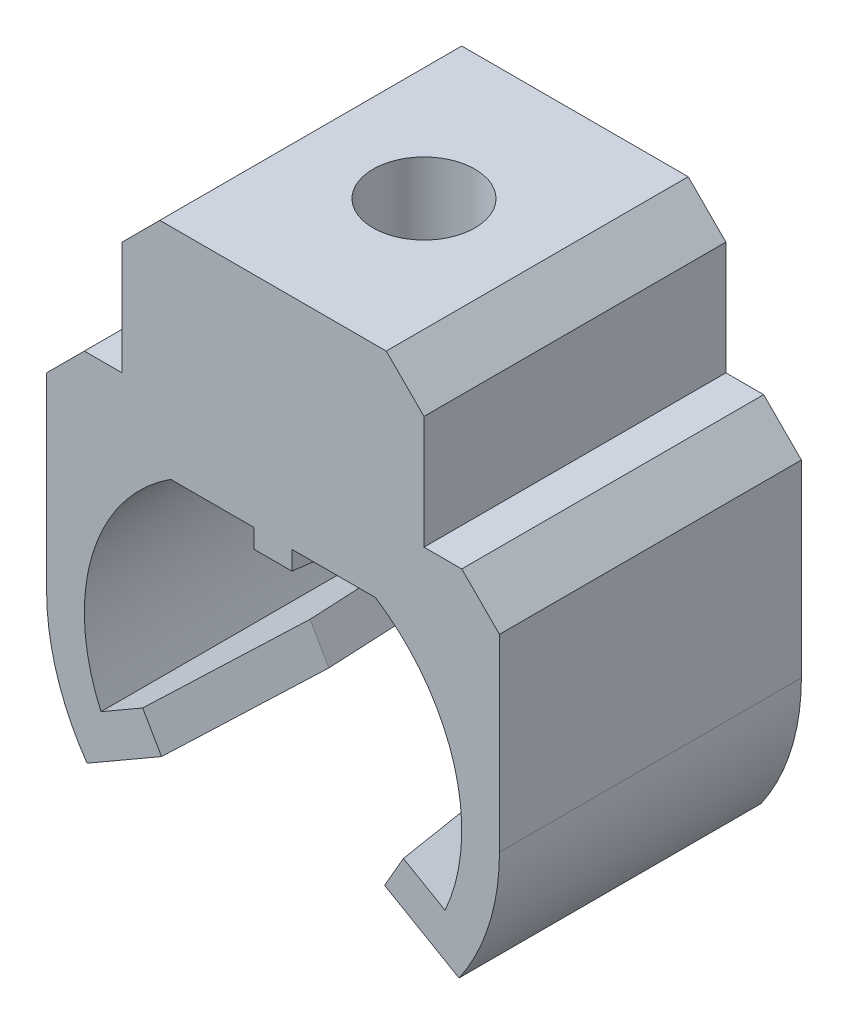
ISO-10303-21;
HEADER;
FILE_DESCRIPTION(('STEP AP214'),'2;1');
FILE_NAME('part.step','',(''),(''),'','','');
FILE_SCHEMA(('AUTOMOTIVE_DESIGN { 1 0 10303 214 1 1 1 1 }'));
ENDSEC;
DATA;
#1=APPLICATION_CONTEXT('core data for automotive mechanical design processes');
#2=APPLICATION_PROTOCOL_DEFINITION('international standard','automotive_design',2000,#1);
#3=PRODUCT_CONTEXT('',#1,'mechanical');
#4=PRODUCT('Part','Part','',(#3));
#5=PRODUCT_RELATED_PRODUCT_CATEGORY('part','',(#4));
#6=PRODUCT_DEFINITION_FORMATION('','',#4);
#7=PRODUCT_DEFINITION_CONTEXT('part definition',#1,'design');
#8=PRODUCT_DEFINITION('design','',#6,#7);
#9=PRODUCT_DEFINITION_SHAPE('','',#8);
#10=(LENGTH_UNIT() NAMED_UNIT(*) SI_UNIT(.MILLI.,.METRE.));
#11=(NAMED_UNIT(*) PLANE_ANGLE_UNIT() SI_UNIT($,.RADIAN.));
#12=(NAMED_UNIT(*) SI_UNIT($,.STERADIAN.) SOLID_ANGLE_UNIT());
#13=UNCERTAINTY_MEASURE_WITH_UNIT(LENGTH_MEASURE(1.E-05),#10,'distance_accuracy_value','');
#14=(GEOMETRIC_REPRESENTATION_CONTEXT(3) GLOBAL_UNCERTAINTY_ASSIGNED_CONTEXT((#13)) GLOBAL_UNIT_ASSIGNED_CONTEXT((#10,
#11,#12)) REPRESENTATION_CONTEXT('',''));
#15=CARTESIAN_POINT('',(0.,0.,0.));
#16=DIRECTION('',(0.,0.,1.));
#17=DIRECTION('',(1.,0.,0.));
#18=AXIS2_PLACEMENT_3D('',#15,#16,#17);
#19=CARTESIAN_POINT('',(0.,0.,8.));
#20=DIRECTION('',(0.,0.,-1.));
#21=DIRECTION('',(-1.,0.,0.));
#22=AXIS2_PLACEMENT_3D('',#19,#20,#21);
#23=CYLINDRICAL_SURFACE('',#22,5.);
#24=CARTESIAN_POINT('',(0.,0.,0.));
#25=DIRECTION('',(0.,0.,-1.));
#26=DIRECTION('',(1.,0.,0.));
#27=AXIS2_PLACEMENT_3D('',#24,#25,#26);
#28=CIRCLE('',#27,5.);
#29=CARTESIAN_POINT('',(2.71293199325011,4.2,0.));
#30=VERTEX_POINT('',#29);
#31=CARTESIAN_POINT('',(4.55842198490352,-2.05445589087434,0.));
#32=VERTEX_POINT('',#31);
#33=EDGE_CURVE('E253',#30,#32,#28,.T.);
#34=ORIENTED_EDGE('',*,*,#33,.T.);
#35=DIRECTION('',(0.,0.,-1.));
#36=VECTOR('',#35,1.);
#37=CARTESIAN_POINT('',(4.55842198490352,-2.05445589087434,8.));
#38=LINE('',#37,#36);
#39=CARTESIAN_POINT('',(4.55842198490352,-2.05445589087434,8.));
#40=VERTEX_POINT('',#39);
#41=EDGE_CURVE('E233',#40,#32,#38,.T.);
#42=ORIENTED_EDGE('',*,*,#41,.F.);
#43=CARTESIAN_POINT('',(0.,0.,8.));
#44=DIRECTION('',(0.,0.,-1.));
#45=DIRECTION('',(1.,0.,0.));
#46=AXIS2_PLACEMENT_3D('',#43,#44,#45);
#47=CIRCLE('',#46,5.);
#48=CARTESIAN_POINT('',(2.71293199325011,4.2,8.));
#49=VERTEX_POINT('',#48);
#50=EDGE_CURVE('E240',#49,#40,#47,.T.);
#51=ORIENTED_EDGE('',*,*,#50,.F.);
#52=DIRECTION('',(0.,0.,-1.));
#53=VECTOR('',#52,1.);
#54=CARTESIAN_POINT('',(2.71293199325011,4.2,8.));
#55=LINE('',#54,#53);
#56=EDGE_CURVE('E365',#49,#30,#55,.T.);
#57=ORIENTED_EDGE('',*,*,#56,.T.);
#58=EDGE_LOOP('',(#34,#42,#51,#57));
#59=FACE_BOUND('',#58,.T.);
#60=ADVANCED_FACE('F35',(#59),#23,.F.);
#61=CARTESIAN_POINT('',(3.0212812921102,-1.16698729810779,8.));
#62=DIRECTION('',(-0.500000000000001,-0.866025403784438,0.));
#63=DIRECTION('',(0.866025403784438,-0.500000000000001,0.));
#64=AXIS2_PLACEMENT_3D('',#61,#62,#63);
#65=PLANE('',#64);
#66=DIRECTION('',(-0.866025403784438,0.500000000000001,0.));
#67=VECTOR('',#66,1.);
#68=CARTESIAN_POINT('',(3.0212812921102,-1.16698729810779,0.));
#69=LINE('',#68,#67);
#70=CARTESIAN_POINT('',(3.45429399400242,-1.41698729810779,0.));
#71=VERTEX_POINT('',#70);
#72=EDGE_CURVE('E372',#32,#71,#69,.T.);
#73=ORIENTED_EDGE('',*,*,#72,.T.);
#74=DIRECTION('',(0.107417231105915,-0.0620173672946044,-0.992277876713668));
#75=VECTOR('',#74,1.);
#76=CARTESIAN_POINT('',(3.0212812921102,-1.16698729810779,4.));
#77=LINE('',#76,#75);
#78=CARTESIAN_POINT('',(3.0212812921102,-1.16698729810779,3.99999999999988));
#79=VERTEX_POINT('',#78);
#80=EDGE_CURVE('E305',#71,#79,#77,.F.);
#81=ORIENTED_EDGE('',*,*,#80,.T.);
#82=DIRECTION('',(0.107417231105912,-0.0620173672946027,0.992277876713668));
#83=VECTOR('',#82,1.);
#84=CARTESIAN_POINT('',(3.45429399400242,-1.41698729810779,8.));
#85=LINE('',#84,#83);
#86=CARTESIAN_POINT('',(3.45429399400242,-1.41698729810779,8.));
#87=VERTEX_POINT('',#86);
#88=EDGE_CURVE('E236',#79,#87,#85,.T.);
#89=ORIENTED_EDGE('',*,*,#88,.T.);
#90=DIRECTION('',(-0.866025403784438,0.500000000000001,0.));
#91=VECTOR('',#90,1.);
#92=CARTESIAN_POINT('',(3.0212812921102,-1.16698729810779,8.));
#93=LINE('',#92,#91);
#94=EDGE_CURVE('E228',#40,#87,#93,.T.);
#95=ORIENTED_EDGE('',*,*,#94,.F.);
#96=ORIENTED_EDGE('',*,*,#41,.T.);
#97=EDGE_LOOP('',(#73,#81,#89,#95,#96));
#98=FACE_BOUND('',#97,.T.);
#99=ADVANCED_FACE('F231',(#98),#65,.F.);
#100=CARTESIAN_POINT('',(2.5212812921102,-2.03301270189222,8.));
#101=DIRECTION('',(0.499999999999998,0.86602540378444,0.));
#102=DIRECTION('',(-0.86602540378444,0.499999999999998,0.));
#103=AXIS2_PLACEMENT_3D('',#100,#101,#102);
#104=PLANE('',#103);
#105=DIRECTION('',(-0.107417231105912,0.0620173672946023,-0.992277876713668));
#106=VECTOR('',#105,1.);
#107=CARTESIAN_POINT('',(2.95429399400242,-2.28301270189222,8.));
#108=LINE('',#107,#106);
#109=CARTESIAN_POINT('',(2.95429399400242,-2.28301270189222,8.));
#110=VERTEX_POINT('',#109);
#111=CARTESIAN_POINT('',(2.5212812921102,-2.03301270189222,3.99999999999988));
#112=VERTEX_POINT('',#111);
#113=EDGE_CURVE('E297',#110,#112,#108,.T.);
#114=ORIENTED_EDGE('',*,*,#113,.T.);
#115=DIRECTION('',(-0.107417231105915,0.062017367294604,0.992277876713668));
#116=VECTOR('',#115,1.);
#117=CARTESIAN_POINT('',(2.5212812921102,-2.03301270189222,4.));
#118=LINE('',#117,#116);
#119=CARTESIAN_POINT('',(2.95429399400242,-2.28301270189222,0.));
#120=VERTEX_POINT('',#119);
#121=EDGE_CURVE('E299',#112,#120,#118,.F.);
#122=ORIENTED_EDGE('',*,*,#121,.T.);
#123=DIRECTION('',(0.86602540378444,-0.499999999999998,0.));
#124=VECTOR('',#123,1.);
#125=CARTESIAN_POINT('',(2.5212812921102,-2.03301270189222,0.));
#126=LINE('',#125,#124);
#127=CARTESIAN_POINT('',(4.928078794302,-3.42257788766757,0.));
#128=VERTEX_POINT('',#127);
#129=EDGE_CURVE('E375',#120,#128,#126,.T.);
#130=ORIENTED_EDGE('',*,*,#129,.T.);
#131=DIRECTION('',(0.,0.,-1.));
#132=VECTOR('',#131,1.);
#133=CARTESIAN_POINT('',(4.928078794302,-3.42257788766757,8.));
#134=LINE('',#133,#132);
#135=CARTESIAN_POINT('',(4.928078794302,-3.42257788766757,8.));
#136=VERTEX_POINT('',#135);
#137=EDGE_CURVE('E255',#136,#128,#134,.T.);
#138=ORIENTED_EDGE('',*,*,#137,.F.);
#139=DIRECTION('',(0.86602540378444,-0.499999999999998,0.));
#140=VECTOR('',#139,1.);
#141=CARTESIAN_POINT('',(2.5212812921102,-2.03301270189222,8.));
#142=LINE('',#141,#140);
#143=EDGE_CURVE('E239',#110,#136,#142,.T.);
#144=ORIENTED_EDGE('',*,*,#143,.F.);
#145=EDGE_LOOP('',(#114,#122,#130,#138,#144));
#146=FACE_BOUND('',#145,.T.);
#147=ADVANCED_FACE('F560',(#146),#104,.F.);
#148=CARTESIAN_POINT('',(0.,0.,8.));
#149=DIRECTION('',(0.,0.,-1.));
#150=DIRECTION('',(-1.,0.,0.));
#151=AXIS2_PLACEMENT_3D('',#148,#149,#150);
#152=CYLINDRICAL_SURFACE('',#151,6.);
#153=CARTESIAN_POINT('',(0.,0.,0.));
#154=DIRECTION('',(0.,0.,1.));
#155=DIRECTION('',(1.,0.,0.));
#156=AXIS2_PLACEMENT_3D('',#153,#154,#155);
#157=CIRCLE('',#156,6.);
#158=CARTESIAN_POINT('',(6.,0.,0.));
#159=VERTEX_POINT('',#158);
#160=EDGE_CURVE('E377',#128,#159,#157,.T.);
#161=ORIENTED_EDGE('',*,*,#160,.T.);
#162=DIRECTION('',(0.,0.,-1.));
#163=VECTOR('',#162,1.);
#164=CARTESIAN_POINT('',(6.,0.,8.));
#165=LINE('',#164,#163);
#166=CARTESIAN_POINT('',(6.,0.,8.));
#167=VERTEX_POINT('',#166);
#168=EDGE_CURVE('E261',#167,#159,#165,.T.);
#169=ORIENTED_EDGE('',*,*,#168,.F.);
#170=CARTESIAN_POINT('',(0.,0.,8.));
#171=DIRECTION('',(0.,0.,1.));
#172=DIRECTION('',(1.,0.,0.));
#173=AXIS2_PLACEMENT_3D('',#170,#171,#172);
#174=CIRCLE('',#173,6.);
#175=EDGE_CURVE('E460',#136,#167,#174,.T.);
#176=ORIENTED_EDGE('',*,*,#175,.F.);
#177=ORIENTED_EDGE('',*,*,#137,.T.);
#178=EDGE_LOOP('',(#161,#169,#176,#177));
#179=FACE_BOUND('',#178,.T.);
#180=ADVANCED_FACE('F688',(#179),#152,.T.);
#181=CARTESIAN_POINT('',(6.,0.,8.));
#182=DIRECTION('',(-1.,0.,0.));
#183=DIRECTION('',(0.,0.,1.));
#184=AXIS2_PLACEMENT_3D('',#181,#182,#183);
#185=PLANE('',#184);
#186=DIRECTION('',(0.,1.,0.));
#187=VECTOR('',#186,1.);
#188=CARTESIAN_POINT('',(6.,0.,0.));
#189=LINE('',#188,#187);
#190=CARTESIAN_POINT('',(6.,5.00000000000001,0.));
#191=VERTEX_POINT('',#190);
#192=EDGE_CURVE('E379',#159,#191,#189,.T.);
#193=ORIENTED_EDGE('',*,*,#192,.T.);
#194=DIRECTION('',(0.,0.,1.));
#195=VECTOR('',#194,1.);
#196=CARTESIAN_POINT('',(6.,5.00000000000001,8.));
#197=LINE('',#196,#195);
#198=CARTESIAN_POINT('',(6.,5.00000000000001,8.));
#199=VERTEX_POINT('',#198);
#200=EDGE_CURVE('E290',#191,#199,#197,.T.);
#201=ORIENTED_EDGE('',*,*,#200,.T.);
#202=DIRECTION('',(0.,1.,0.));
#203=VECTOR('',#202,1.);
#204=CARTESIAN_POINT('',(6.,0.,8.));
#205=LINE('',#204,#203);
#206=EDGE_CURVE('E438',#167,#199,#205,.T.);
#207=ORIENTED_EDGE('',*,*,#206,.F.);
#208=ORIENTED_EDGE('',*,*,#168,.T.);
#209=EDGE_LOOP('',(#193,#201,#207,#208));
#210=FACE_BOUND('',#209,.T.);
#211=ADVANCED_FACE('F435',(#210),#185,.F.);
#212=CARTESIAN_POINT('',(4.,6.00000000000001,8.));
#213=DIRECTION('',(0.,-1.,0.));
#214=DIRECTION('',(1.,0.,0.));
#215=AXIS2_PLACEMENT_3D('',#212,#213,#214);
#216=PLANE('',#215);
#217=DIRECTION('',(-1.,0.,0.));
#218=VECTOR('',#217,1.);
#219=CARTESIAN_POINT('',(4.,6.00000000000001,8.));
#220=LINE('',#219,#218);
#221=CARTESIAN_POINT('',(5.,6.00000000000001,8.));
#222=VERTEX_POINT('',#221);
#223=CARTESIAN_POINT('',(4.,6.00000000000001,8.));
#224=VERTEX_POINT('',#223);
#225=EDGE_CURVE('E453',#222,#224,#220,.T.);
#226=ORIENTED_EDGE('',*,*,#225,.F.);
#227=DIRECTION('',(0.,0.,-1.));
#228=VECTOR('',#227,1.);
#229=CARTESIAN_POINT('',(5.,6.00000000000001,8.));
#230=LINE('',#229,#228);
#231=CARTESIAN_POINT('',(5.,6.00000000000001,0.));
#232=VERTEX_POINT('',#231);
#233=EDGE_CURVE('E287',#222,#232,#230,.T.);
#234=ORIENTED_EDGE('',*,*,#233,.T.);
#235=DIRECTION('',(-1.,0.,0.));
#236=VECTOR('',#235,1.);
#237=CARTESIAN_POINT('',(4.,6.00000000000001,0.));
#238=LINE('',#237,#236);
#239=CARTESIAN_POINT('',(4.,6.00000000000001,0.));
#240=VERTEX_POINT('',#239);
#241=EDGE_CURVE('E382',#232,#240,#238,.T.);
#242=ORIENTED_EDGE('',*,*,#241,.T.);
#243=DIRECTION('',(0.,0.,-1.));
#244=VECTOR('',#243,1.);
#245=CARTESIAN_POINT('',(4.,6.00000000000001,8.));
#246=LINE('',#245,#244);
#247=EDGE_CURVE('E428',#224,#240,#246,.T.);
#248=ORIENTED_EDGE('',*,*,#247,.F.);
#249=EDGE_LOOP('',(#226,#234,#242,#248));
#250=FACE_BOUND('',#249,.T.);
#251=ADVANCED_FACE('F451',(#250),#216,.F.);
#252=CARTESIAN_POINT('',(4.,9.99999999999999,8.));
#253=DIRECTION('',(-1.,0.,0.));
#254=DIRECTION('',(0.,-1.,0.));
#255=AXIS2_PLACEMENT_3D('',#252,#253,#254);
#256=PLANE('',#255);
#257=DIRECTION('',(0.,1.,0.));
#258=VECTOR('',#257,1.);
#259=CARTESIAN_POINT('',(4.,9.99999999999999,0.));
#260=LINE('',#259,#258);
#261=CARTESIAN_POINT('',(4.,8.99999999999998,0.));
#262=VERTEX_POINT('',#261);
#263=EDGE_CURVE('E384',#240,#262,#260,.T.);
#264=ORIENTED_EDGE('',*,*,#263,.T.);
#265=DIRECTION('',(0.,0.,1.));
#266=VECTOR('',#265,1.);
#267=CARTESIAN_POINT('',(4.,8.99999999999998,8.));
#268=LINE('',#267,#266);
#269=CARTESIAN_POINT('',(4.,8.99999999999999,8.));
#270=VERTEX_POINT('',#269);
#271=EDGE_CURVE('E285',#262,#270,#268,.T.);
#272=ORIENTED_EDGE('',*,*,#271,.T.);
#273=DIRECTION('',(0.,1.,0.));
#274=VECTOR('',#273,1.);
#275=CARTESIAN_POINT('',(4.,9.99999999999999,8.));
#276=LINE('',#275,#274);
#277=EDGE_CURVE('E456',#224,#270,#276,.T.);
#278=ORIENTED_EDGE('',*,*,#277,.F.);
#279=ORIENTED_EDGE('',*,*,#247,.T.);
#280=EDGE_LOOP('',(#264,#272,#278,#279));
#281=FACE_BOUND('',#280,.T.);
#282=ADVANCED_FACE('F545',(#281),#256,.F.);
#283=CARTESIAN_POINT('',(-4.,9.99999999999999,8.));
#284=DIRECTION('',(0.,-1.,0.));
#285=DIRECTION('',(0.,0.,-1.));
#286=AXIS2_PLACEMENT_3D('',#283,#284,#285);
#287=PLANE('',#286);
#288=CARTESIAN_POINT('',(0.,9.99999999999999,4.));
#289=DIRECTION('',(0.,1.,0.));
#290=DIRECTION('',(0.,0.,1.));
#291=AXIS2_PLACEMENT_3D('',#288,#289,#290);
#292=CIRCLE('',#291,1.35);
#293=CARTESIAN_POINT('',(0.,9.99999999999999,5.35));
#294=VERTEX_POINT('',#293);
#295=EDGE_CURVE('E335',#294,#294,#292,.T.);
#296=ORIENTED_EDGE('',*,*,#295,.F.);
#297=EDGE_LOOP('',(#296));
#298=FACE_BOUND('',#297,.T.);
#299=DIRECTION('',(-1.,0.,0.));
#300=VECTOR('',#299,1.);
#301=CARTESIAN_POINT('',(-4.,9.99999999999999,0.));
#302=LINE('',#301,#300);
#303=CARTESIAN_POINT('',(2.99999999999999,9.99999999999999,0.));
#304=VERTEX_POINT('',#303);
#305=CARTESIAN_POINT('',(-3.,9.99999999999999,0.));
#306=VERTEX_POINT('',#305);
#307=EDGE_CURVE('E387',#304,#306,#302,.T.);
#308=ORIENTED_EDGE('',*,*,#307,.T.);
#309=DIRECTION('',(0.,0.,1.));
#310=VECTOR('',#309,1.);
#311=CARTESIAN_POINT('',(-3.,9.99999999999999,8.));
#312=LINE('',#311,#310);
#313=CARTESIAN_POINT('',(-3.,9.99999999999999,8.));
#314=VERTEX_POINT('',#313);
#315=EDGE_CURVE('E275',#306,#314,#312,.T.);
#316=ORIENTED_EDGE('',*,*,#315,.T.);
#317=DIRECTION('',(-1.,0.,0.));
#318=VECTOR('',#317,1.);
#319=CARTESIAN_POINT('',(-4.,9.99999999999999,8.));
#320=LINE('',#319,#318);
#321=CARTESIAN_POINT('',(2.99999999999999,9.99999999999999,8.));
#322=VERTEX_POINT('',#321);
#323=EDGE_CURVE('E458',#322,#314,#320,.T.);
#324=ORIENTED_EDGE('',*,*,#323,.F.);
#325=DIRECTION('',(0.,0.,-1.));
#326=VECTOR('',#325,1.);
#327=CARTESIAN_POINT('',(2.99999999999999,9.99999999999999,8.));
#328=LINE('',#327,#326);
#329=EDGE_CURVE('E272',#322,#304,#328,.T.);
#330=ORIENTED_EDGE('',*,*,#329,.T.);
#331=EDGE_LOOP('',(#308,#316,#324,#330));
#332=FACE_BOUND('',#331,.T.);
#333=ADVANCED_FACE('F535',(#298,#332),#287,.F.);
#334=CARTESIAN_POINT('',(-4.,5.99999999999999,8.));
#335=DIRECTION('',(1.,0.,0.));
#336=DIRECTION('',(0.,1.,0.));
#337=AXIS2_PLACEMENT_3D('',#334,#335,#336);
#338=PLANE('',#337);
#339=DIRECTION('',(0.,-1.,0.));
#340=VECTOR('',#339,1.);
#341=CARTESIAN_POINT('',(-4.,5.99999999999999,8.));
#342=LINE('',#341,#340);
#343=CARTESIAN_POINT('',(-4.,8.99999999999999,8.));
#344=VERTEX_POINT('',#343);
#345=CARTESIAN_POINT('',(-4.,5.99999999999999,8.));
#346=VERTEX_POINT('',#345);
#347=EDGE_CURVE('E466',#344,#346,#342,.T.);
#348=ORIENTED_EDGE('',*,*,#347,.F.);
#349=DIRECTION('',(0.,0.,-1.));
#350=VECTOR('',#349,1.);
#351=CARTESIAN_POINT('',(-4.,8.99999999999999,8.));
#352=LINE('',#351,#350);
#353=CARTESIAN_POINT('',(-4.,8.99999999999999,0.));
#354=VERTEX_POINT('',#353);
#355=EDGE_CURVE('E254',#344,#354,#352,.T.);
#356=ORIENTED_EDGE('',*,*,#355,.T.);
#357=DIRECTION('',(0.,-1.,0.));
#358=VECTOR('',#357,1.);
#359=CARTESIAN_POINT('',(-4.,5.99999999999999,0.));
#360=LINE('',#359,#358);
#361=CARTESIAN_POINT('',(-4.,5.99999999999999,0.));
#362=VERTEX_POINT('',#361);
#363=EDGE_CURVE('E390',#354,#362,#360,.T.);
#364=ORIENTED_EDGE('',*,*,#363,.T.);
#365=DIRECTION('',(0.,0.,-1.));
#366=VECTOR('',#365,1.);
#367=CARTESIAN_POINT('',(-4.,5.99999999999999,8.));
#368=LINE('',#367,#366);
#369=EDGE_CURVE('E425',#346,#362,#368,.T.);
#370=ORIENTED_EDGE('',*,*,#369,.F.);
#371=EDGE_LOOP('',(#348,#356,#364,#370));
#372=FACE_BOUND('',#371,.T.);
#373=ADVANCED_FACE('F529',(#372),#338,.F.);
#374=CARTESIAN_POINT('',(-6.,5.99999999999999,8.));
#375=DIRECTION('',(0.,-1.,0.));
#376=DIRECTION('',(1.,0.,0.));
#377=AXIS2_PLACEMENT_3D('',#374,#375,#376);
#378=PLANE('',#377);
#379=DIRECTION('',(-1.,0.,0.));
#380=VECTOR('',#379,1.);
#381=CARTESIAN_POINT('',(-6.,5.99999999999999,0.));
#382=LINE('',#381,#380);
#383=CARTESIAN_POINT('',(-5.,5.99999999999999,0.));
#384=VERTEX_POINT('',#383);
#385=EDGE_CURVE('E392',#362,#384,#382,.T.);
#386=ORIENTED_EDGE('',*,*,#385,.T.);
#387=DIRECTION('',(0.,0.,1.));
#388=VECTOR('',#387,1.);
#389=CARTESIAN_POINT('',(-5.,5.99999999999999,8.));
#390=LINE('',#389,#388);
#391=CARTESIAN_POINT('',(-5.,5.99999999999999,8.));
#392=VERTEX_POINT('',#391);
#393=EDGE_CURVE('E295',#384,#392,#390,.T.);
#394=ORIENTED_EDGE('',*,*,#393,.T.);
#395=DIRECTION('',(-1.,0.,0.));
#396=VECTOR('',#395,1.);
#397=CARTESIAN_POINT('',(-6.,5.99999999999999,8.));
#398=LINE('',#397,#396);
#399=EDGE_CURVE('E468',#346,#392,#398,.T.);
#400=ORIENTED_EDGE('',*,*,#399,.F.);
#401=ORIENTED_EDGE('',*,*,#369,.T.);
#402=EDGE_LOOP('',(#386,#394,#400,#401));
#403=FACE_BOUND('',#402,.T.);
#404=ADVANCED_FACE('F524',(#403),#378,.F.);
#405=CARTESIAN_POINT('',(-6.,0.,8.));
#406=DIRECTION('',(1.,0.,0.));
#407=DIRECTION('',(0.,0.,-1.));
#408=AXIS2_PLACEMENT_3D('',#405,#406,#407);
#409=PLANE('',#408);
#410=DIRECTION('',(0.,-1.,0.));
#411=VECTOR('',#410,1.);
#412=CARTESIAN_POINT('',(-6.,0.,8.));
#413=LINE('',#412,#411);
#414=CARTESIAN_POINT('',(-6.,4.99999999999999,8.));
#415=VERTEX_POINT('',#414);
#416=CARTESIAN_POINT('',(-6.,0.,8.));
#417=VERTEX_POINT('',#416);
#418=EDGE_CURVE('E471',#415,#417,#413,.T.);
#419=ORIENTED_EDGE('',*,*,#418,.F.);
#420=DIRECTION('',(0.,0.,-1.));
#421=VECTOR('',#420,1.);
#422=CARTESIAN_POINT('',(-6.,4.99999999999999,8.));
#423=LINE('',#422,#421);
#424=CARTESIAN_POINT('',(-6.,4.99999999999999,0.));
#425=VERTEX_POINT('',#424);
#426=EDGE_CURVE('E292',#415,#425,#423,.T.);
#427=ORIENTED_EDGE('',*,*,#426,.T.);
#428=DIRECTION('',(0.,-1.,0.));
#429=VECTOR('',#428,1.);
#430=CARTESIAN_POINT('',(-6.,0.,0.));
#431=LINE('',#430,#429);
#432=CARTESIAN_POINT('',(-6.,0.,0.));
#433=VERTEX_POINT('',#432);
#434=EDGE_CURVE('E395',#425,#433,#431,.T.);
#435=ORIENTED_EDGE('',*,*,#434,.T.);
#436=DIRECTION('',(0.,0.,-1.));
#437=VECTOR('',#436,1.);
#438=CARTESIAN_POINT('',(-6.,0.,8.));
#439=LINE('',#438,#437);
#440=EDGE_CURVE('E422',#417,#433,#439,.T.);
#441=ORIENTED_EDGE('',*,*,#440,.F.);
#442=EDGE_LOOP('',(#419,#427,#435,#441));
#443=FACE_BOUND('',#442,.T.);
#444=ADVANCED_FACE('F515',(#443),#409,.F.);
#445=CARTESIAN_POINT('',(0.,0.,8.));
#446=DIRECTION('',(0.,0.,-1.));
#447=DIRECTION('',(-1.,0.,0.));
#448=AXIS2_PLACEMENT_3D('',#445,#446,#447);
#449=CYLINDRICAL_SURFACE('',#448,6.);
#450=CARTESIAN_POINT('',(0.,0.,0.));
#451=DIRECTION('',(0.,0.,1.));
#452=DIRECTION('',(1.,0.,0.));
#453=AXIS2_PLACEMENT_3D('',#450,#451,#452);
#454=CIRCLE('',#453,6.);
#455=CARTESIAN_POINT('',(-4.92807879430202,-3.42257788766754,0.));
#456=VERTEX_POINT('',#455);
#457=EDGE_CURVE('E397',#433,#456,#454,.T.);
#458=ORIENTED_EDGE('',*,*,#457,.T.);
#459=DIRECTION('',(0.,0.,-1.));
#460=VECTOR('',#459,1.);
#461=CARTESIAN_POINT('',(-4.92807879430202,-3.42257788766754,8.));
#462=LINE('',#461,#460);
#463=CARTESIAN_POINT('',(-4.92807879430202,-3.42257788766754,8.));
#464=VERTEX_POINT('',#463);
#465=EDGE_CURVE('E419',#464,#456,#462,.T.);
#466=ORIENTED_EDGE('',*,*,#465,.F.);
#467=CARTESIAN_POINT('',(0.,0.,8.));
#468=DIRECTION('',(0.,0.,1.));
#469=DIRECTION('',(1.,0.,0.));
#470=AXIS2_PLACEMENT_3D('',#467,#468,#469);
#471=CIRCLE('',#470,6.);
#472=EDGE_CURVE('E473',#417,#464,#471,.T.);
#473=ORIENTED_EDGE('',*,*,#472,.F.);
#474=ORIENTED_EDGE('',*,*,#440,.T.);
#475=EDGE_LOOP('',(#458,#466,#473,#474));
#476=FACE_BOUND('',#475,.T.);
#477=ADVANCED_FACE('F511',(#476),#449,.T.);
#478=CARTESIAN_POINT('',(-2.52128129211022,-2.0330127018922,8.));
#479=DIRECTION('',(-0.499999999999995,0.866025403784441,0.));
#480=DIRECTION('',(-0.866025403784442,-0.499999999999995,0.));
#481=AXIS2_PLACEMENT_3D('',#478,#479,#480);
#482=PLANE('',#481);
#483=DIRECTION('',(0.866025403784441,0.499999999999995,0.));
#484=VECTOR('',#483,1.);
#485=CARTESIAN_POINT('',(-2.52128129211022,-2.0330127018922,0.));
#486=LINE('',#485,#484);
#487=CARTESIAN_POINT('',(-2.95429399400244,-2.2830127018922,0.));
#488=VERTEX_POINT('',#487);
#489=EDGE_CURVE('E399',#456,#488,#486,.T.);
#490=ORIENTED_EDGE('',*,*,#489,.T.);
#491=DIRECTION('',(-0.107417231105912,-0.062017367294602,-0.992277876713668));
#492=VECTOR('',#491,1.);
#493=CARTESIAN_POINT('',(-2.52128129211022,-2.0330127018922,4.00000000000011));
#494=LINE('',#493,#492);
#495=CARTESIAN_POINT('',(-2.52128129211022,-2.0330127018922,3.99999999999988));
#496=VERTEX_POINT('',#495);
#497=EDGE_CURVE('E339',#488,#496,#494,.F.);
#498=ORIENTED_EDGE('',*,*,#497,.T.);
#499=DIRECTION('',(-0.107417231105913,-0.062017367294602,0.992277876713668));
#500=VECTOR('',#499,1.);
#501=CARTESIAN_POINT('',(-2.95429399400244,-2.2830127018922,8.));
#502=LINE('',#501,#500);
#503=CARTESIAN_POINT('',(-2.95429399400244,-2.2830127018922,8.));
#504=VERTEX_POINT('',#503);
#505=EDGE_CURVE('E329',#496,#504,#502,.T.);
#506=ORIENTED_EDGE('',*,*,#505,.T.);
#507=DIRECTION('',(0.866025403784441,0.499999999999995,0.));
#508=VECTOR('',#507,1.);
#509=CARTESIAN_POINT('',(-2.52128129211022,-2.0330127018922,8.));
#510=LINE('',#509,#508);
#511=EDGE_CURVE('E475',#464,#504,#510,.T.);
#512=ORIENTED_EDGE('',*,*,#511,.F.);
#513=ORIENTED_EDGE('',*,*,#465,.T.);
#514=EDGE_LOOP('',(#490,#498,#506,#512,#513));
#515=FACE_BOUND('',#514,.T.);
#516=ADVANCED_FACE('F501',(#515),#482,.F.);
#517=CARTESIAN_POINT('',(-3.02128129211021,-1.16698729810776,8.));
#518=DIRECTION('',(0.499999999999995,-0.866025403784442,0.));
#519=DIRECTION('',(0.866025403784442,0.499999999999995,0.));
#520=AXIS2_PLACEMENT_3D('',#517,#518,#519);
#521=PLANE('',#520);
#522=DIRECTION('',(0.107417231105913,0.0620173672946019,-0.992277876713668));
#523=VECTOR('',#522,1.);
#524=CARTESIAN_POINT('',(-3.45429399400243,-1.41698729810776,8.));
#525=LINE('',#524,#523);
#526=CARTESIAN_POINT('',(-3.45429399400243,-1.41698729810776,8.));
#527=VERTEX_POINT('',#526);
#528=CARTESIAN_POINT('',(-3.02128129211021,-1.16698729810776,3.99999999999989));
#529=VERTEX_POINT('',#528);
#530=EDGE_CURVE('E323',#527,#529,#525,.T.);
#531=ORIENTED_EDGE('',*,*,#530,.T.);
#532=DIRECTION('',(0.107417231105912,0.0620173672946019,0.992277876713668));
#533=VECTOR('',#532,1.);
#534=CARTESIAN_POINT('',(-3.02128129211021,-1.16698729810776,4.00000000000011));
#535=LINE('',#534,#533);
#536=CARTESIAN_POINT('',(-3.45429399400243,-1.41698729810776,0.));
#537=VERTEX_POINT('',#536);
#538=EDGE_CURVE('E331',#529,#537,#535,.F.);
#539=ORIENTED_EDGE('',*,*,#538,.T.);
#540=DIRECTION('',(-0.866025403784442,-0.499999999999995,0.));
#541=VECTOR('',#540,1.);
#542=CARTESIAN_POINT('',(-3.02128129211021,-1.16698729810776,0.));
#543=LINE('',#542,#541);
#544=CARTESIAN_POINT('',(-4.55842198490353,-2.0544558908743,0.));
#545=VERTEX_POINT('',#544);
#546=EDGE_CURVE('E401',#537,#545,#543,.T.);
#547=ORIENTED_EDGE('',*,*,#546,.T.);
#548=DIRECTION('',(0.,0.,-1.));
#549=VECTOR('',#548,1.);
#550=CARTESIAN_POINT('',(-4.55842198490353,-2.0544558908743,8.));
#551=LINE('',#550,#549);
#552=CARTESIAN_POINT('',(-4.55842198490353,-2.0544558908743,8.));
#553=VERTEX_POINT('',#552);
#554=EDGE_CURVE('E416',#553,#545,#551,.T.);
#555=ORIENTED_EDGE('',*,*,#554,.F.);
#556=DIRECTION('',(-0.866025403784442,-0.499999999999995,0.));
#557=VECTOR('',#556,1.);
#558=CARTESIAN_POINT('',(-3.02128129211021,-1.16698729810776,8.));
#559=LINE('',#558,#557);
#560=EDGE_CURVE('E478',#527,#553,#559,.T.);
#561=ORIENTED_EDGE('',*,*,#560,.F.);
#562=EDGE_LOOP('',(#531,#539,#547,#555,#561));
#563=FACE_BOUND('',#562,.T.);
#564=ADVANCED_FACE('F494',(#563),#521,.F.);
#565=CARTESIAN_POINT('',(0.,0.,8.));
#566=DIRECTION('',(0.,0.,-1.));
#567=DIRECTION('',(-1.,0.,0.));
#568=AXIS2_PLACEMENT_3D('',#565,#566,#567);
#569=CYLINDRICAL_SURFACE('',#568,5.);
#570=CARTESIAN_POINT('',(0.,0.,0.));
#571=DIRECTION('',(0.,0.,-1.));
#572=DIRECTION('',(1.,0.,0.));
#573=AXIS2_PLACEMENT_3D('',#570,#571,#572);
#574=CIRCLE('',#573,5.);
#575=CARTESIAN_POINT('',(-2.71293199325011,4.2,0.));
#576=VERTEX_POINT('',#575);
#577=EDGE_CURVE('E403',#545,#576,#574,.T.);
#578=ORIENTED_EDGE('',*,*,#577,.T.);
#579=DIRECTION('',(0.,0.,-1.));
#580=VECTOR('',#579,1.);
#581=CARTESIAN_POINT('',(-2.71293199325011,4.2,8.));
#582=LINE('',#581,#580);
#583=CARTESIAN_POINT('',(-2.71293199325011,4.2,8.));
#584=VERTEX_POINT('',#583);
#585=EDGE_CURVE('E413',#584,#576,#582,.T.);
#586=ORIENTED_EDGE('',*,*,#585,.F.);
#587=CARTESIAN_POINT('',(0.,0.,8.));
#588=DIRECTION('',(0.,0.,-1.));
#589=DIRECTION('',(1.,0.,0.));
#590=AXIS2_PLACEMENT_3D('',#587,#588,#589);
#591=CIRCLE('',#590,5.);
#592=EDGE_CURVE('E480',#553,#584,#591,.T.);
#593=ORIENTED_EDGE('',*,*,#592,.F.);
#594=ORIENTED_EDGE('',*,*,#554,.T.);
#595=EDGE_LOOP('',(#578,#586,#593,#594));
#596=FACE_BOUND('',#595,.T.);
#597=ADVANCED_FACE('F490',(#596),#569,.F.);
#598=CARTESIAN_POINT('',(-2.71293199325011,4.2,8.));
#599=DIRECTION('',(0.,1.,0.));
#600=DIRECTION('',(0.,0.,1.));
#601=AXIS2_PLACEMENT_3D('',#598,#599,#600);
#602=PLANE('',#601);
#603=DIRECTION('',(1.,0.,0.));
#604=VECTOR('',#603,1.);
#605=CARTESIAN_POINT('',(-2.71293199325011,4.2,0.));
#606=LINE('',#605,#604);
#607=CARTESIAN_POINT('',(-0.5,4.2,0.));
#608=VERTEX_POINT('',#607);
#609=EDGE_CURVE('E405',#576,#608,#606,.T.);
#610=ORIENTED_EDGE('',*,*,#609,.T.);
#611=DIRECTION('',(0.,0.,-1.));
#612=VECTOR('',#611,1.);
#613=CARTESIAN_POINT('',(-0.5,4.2,8.));
#614=LINE('',#613,#612);
#615=CARTESIAN_POINT('',(-0.5,4.2,8.));
#616=VERTEX_POINT('',#615);
#617=EDGE_CURVE('E411',#616,#608,#614,.T.);
#618=ORIENTED_EDGE('',*,*,#617,.F.);
#619=DIRECTION('',(1.,0.,0.));
#620=VECTOR('',#619,1.);
#621=CARTESIAN_POINT('',(-2.71293199325011,4.2,8.));
#622=LINE('',#621,#620);
#623=EDGE_CURVE('E367',#584,#616,#622,.T.);
#624=ORIENTED_EDGE('',*,*,#623,.F.);
#625=ORIENTED_EDGE('',*,*,#585,.T.);
#626=EDGE_LOOP('',(#610,#618,#624,#625));
#627=FACE_BOUND('',#626,.T.);
#628=ADVANCED_FACE('F486',(#627),#602,.F.);
#629=CARTESIAN_POINT('',(-0.5,3.2,8.));
#630=DIRECTION('',(1.,0.,0.));
#631=DIRECTION('',(0.,0.,-1.));
#632=AXIS2_PLACEMENT_3D('',#629,#630,#631);
#633=PLANE('',#632);
#634=DIRECTION('',(0.,-1.,0.));
#635=VECTOR('',#634,1.);
#636=CARTESIAN_POINT('',(-0.5,3.2,0.));
#637=LINE('',#636,#635);
#638=CARTESIAN_POINT('',(-0.5,3.7,0.));
#639=VERTEX_POINT('',#638);
#640=EDGE_CURVE('E350',#608,#639,#637,.T.);
#641=ORIENTED_EDGE('',*,*,#640,.T.);
#642=DIRECTION('',(0.,0.124034734589205,-0.992277876713668));
#643=VECTOR('',#642,1.);
#644=CARTESIAN_POINT('',(-0.5,3.2,4.00000000000011));
#645=LINE('',#644,#643);
#646=CARTESIAN_POINT('',(-0.5,3.2,3.99999999999989));
#647=VERTEX_POINT('',#646);
#648=EDGE_CURVE('E11',#639,#647,#645,.F.);
#649=ORIENTED_EDGE('',*,*,#648,.T.);
#650=DIRECTION('',(0.,0.124034734589205,0.992277876713668));
#651=VECTOR('',#650,1.);
#652=CARTESIAN_POINT('',(-0.5,3.7,8.));
#653=LINE('',#652,#651);
#654=CARTESIAN_POINT('',(-0.5,3.7,8.));
#655=VERTEX_POINT('',#654);
#656=EDGE_CURVE('E321',#647,#655,#653,.T.);
#657=ORIENTED_EDGE('',*,*,#656,.T.);
#658=DIRECTION('',(0.,-1.,0.));
#659=VECTOR('',#658,1.);
#660=CARTESIAN_POINT('',(-0.5,3.2,8.));
#661=LINE('',#660,#659);
#662=EDGE_CURVE('E362',#616,#655,#661,.T.);
#663=ORIENTED_EDGE('',*,*,#662,.F.);
#664=ORIENTED_EDGE('',*,*,#617,.T.);
#665=EDGE_LOOP('',(#641,#649,#657,#663,#664));
#666=FACE_BOUND('',#665,.T.);
#667=ADVANCED_FACE('F355',(#666),#633,.F.);
#668=CARTESIAN_POINT('',(0.5,3.2,8.));
#669=DIRECTION('',(-1.,0.,0.));
#670=DIRECTION('',(0.,0.,1.));
#671=AXIS2_PLACEMENT_3D('',#668,#669,#670);
#672=PLANE('',#671);
#673=DIRECTION('',(0.,-0.124034734589205,-0.992277876713668));
#674=VECTOR('',#673,1.);
#675=CARTESIAN_POINT('',(0.5,3.7,8.));
#676=LINE('',#675,#674);
#677=CARTESIAN_POINT('',(0.5,3.7,8.));
#678=VERTEX_POINT('',#677);
#679=CARTESIAN_POINT('',(0.5,3.2,3.99999999999989));
#680=VERTEX_POINT('',#679);
#681=EDGE_CURVE('E315',#678,#680,#676,.T.);
#682=ORIENTED_EDGE('',*,*,#681,.T.);
#683=DIRECTION('',(0.,-0.124034734589205,0.992277876713668));
#684=VECTOR('',#683,1.);
#685=CARTESIAN_POINT('',(0.5,3.2,4.00000000000011));
#686=LINE('',#685,#684);
#687=CARTESIAN_POINT('',(0.5,3.7,0.));
#688=VERTEX_POINT('',#687);
#689=EDGE_CURVE('E43',#680,#688,#686,.F.);
#690=ORIENTED_EDGE('',*,*,#689,.T.);
#691=DIRECTION('',(0.,1.,0.));
#692=VECTOR('',#691,1.);
#693=CARTESIAN_POINT('',(0.5,3.2,0.));
#694=LINE('',#693,#692);
#695=CARTESIAN_POINT('',(0.5,4.2,0.));
#696=VERTEX_POINT('',#695);
#697=EDGE_CURVE('E343',#688,#696,#694,.T.);
#698=ORIENTED_EDGE('',*,*,#697,.T.);
#699=DIRECTION('',(0.,0.,-1.));
#700=VECTOR('',#699,1.);
#701=CARTESIAN_POINT('',(0.5,4.2,8.));
#702=LINE('',#701,#700);
#703=CARTESIAN_POINT('',(0.5,4.2,8.));
#704=VERTEX_POINT('',#703);
#705=EDGE_CURVE('E363',#704,#696,#702,.T.);
#706=ORIENTED_EDGE('',*,*,#705,.F.);
#707=DIRECTION('',(0.,1.,0.));
#708=VECTOR('',#707,1.);
#709=CARTESIAN_POINT('',(0.5,3.2,8.));
#710=LINE('',#709,#708);
#711=EDGE_CURVE('E361',#678,#704,#710,.T.);
#712=ORIENTED_EDGE('',*,*,#711,.F.);
#713=EDGE_LOOP('',(#682,#690,#698,#706,#712));
#714=FACE_BOUND('',#713,.T.);
#715=ADVANCED_FACE('F341',(#714),#672,.F.);
#716=CARTESIAN_POINT('',(0.5,4.2,8.));
#717=DIRECTION('',(0.,1.,0.));
#718=DIRECTION('',(0.,0.,1.));
#719=AXIS2_PLACEMENT_3D('',#716,#717,#718);
#720=PLANE('',#719);
#721=DIRECTION('',(1.,0.,0.));
#722=VECTOR('',#721,1.);
#723=CARTESIAN_POINT('',(0.5,4.2,0.));
#724=LINE('',#723,#722);
#725=EDGE_CURVE('E250',#696,#30,#724,.T.);
#726=ORIENTED_EDGE('',*,*,#725,.T.);
#727=ORIENTED_EDGE('',*,*,#56,.F.);
#728=DIRECTION('',(1.,0.,0.));
#729=VECTOR('',#728,1.);
#730=CARTESIAN_POINT('',(0.5,4.2,8.));
#731=LINE('',#730,#729);
#732=EDGE_CURVE('E246',#704,#49,#731,.T.);
#733=ORIENTED_EDGE('',*,*,#732,.F.);
#734=ORIENTED_EDGE('',*,*,#705,.T.);
#735=EDGE_LOOP('',(#726,#727,#733,#734));
#736=FACE_BOUND('',#735,.T.);
#737=ADVANCED_FACE('F629',(#736),#720,.F.);
#738=CARTESIAN_POINT('',(0.,0.,8.));
#739=DIRECTION('',(0.,0.,1.));
#740=DIRECTION('',(1.,0.,0.));
#741=AXIS2_PLACEMENT_3D('',#738,#739,#740);
#742=PLANE('',#741);
#743=ORIENTED_EDGE('',*,*,#662,.T.);
#744=DIRECTION('',(1.,0.,0.));
#745=VECTOR('',#744,1.);
#746=CARTESIAN_POINT('',(0.5,3.7,8.));
#747=LINE('',#746,#745);
#748=EDGE_CURVE('E312',#655,#678,#747,.T.);
#749=ORIENTED_EDGE('',*,*,#748,.T.);
#750=ORIENTED_EDGE('',*,*,#711,.T.);
#751=ORIENTED_EDGE('',*,*,#732,.T.);
#752=ORIENTED_EDGE('',*,*,#50,.T.);
#753=ORIENTED_EDGE('',*,*,#94,.T.);
#754=DIRECTION('',(-0.500000000000001,-0.866025403784438,0.));
#755=VECTOR('',#754,1.);
#756=CARTESIAN_POINT('',(2.95429399400242,-2.28301270189223,8.));
#757=LINE('',#756,#755);
#758=EDGE_CURVE('E307',#87,#110,#757,.T.);
#759=ORIENTED_EDGE('',*,*,#758,.T.);
#760=ORIENTED_EDGE('',*,*,#143,.T.);
#761=ORIENTED_EDGE('',*,*,#175,.T.);
#762=ORIENTED_EDGE('',*,*,#206,.T.);
#763=DIRECTION('',(0.707106781186546,-0.707106781186549,0.));
#764=VECTOR('',#763,1.);
#765=CARTESIAN_POINT('',(5.50000000000001,5.5,8.));
#766=LINE('',#765,#764);
#767=EDGE_CURVE('E279',#199,#222,#766,.F.);
#768=ORIENTED_EDGE('',*,*,#767,.T.);
#769=ORIENTED_EDGE('',*,*,#225,.T.);
#770=ORIENTED_EDGE('',*,*,#277,.T.);
#771=DIRECTION('',(0.707106781186546,-0.707106781186549,0.));
#772=VECTOR('',#771,1.);
#773=CARTESIAN_POINT('',(6.5,6.49999999999998,8.));
#774=LINE('',#773,#772);
#775=EDGE_CURVE('E281',#270,#322,#774,.F.);
#776=ORIENTED_EDGE('',*,*,#775,.T.);
#777=ORIENTED_EDGE('',*,*,#323,.T.);
#778=DIRECTION('',(0.707106781186549,0.707106781186546,0.));
#779=VECTOR('',#778,1.);
#780=CARTESIAN_POINT('',(-6.49999999999999,6.50000000000001,8.));
#781=LINE('',#780,#779);
#782=EDGE_CURVE('E283',#314,#344,#781,.F.);
#783=ORIENTED_EDGE('',*,*,#782,.T.);
#784=ORIENTED_EDGE('',*,*,#347,.T.);
#785=ORIENTED_EDGE('',*,*,#399,.T.);
#786=DIRECTION('',(0.707106781186548,0.707106781186547,0.));
#787=VECTOR('',#786,1.);
#788=CARTESIAN_POINT('',(-5.49999999999999,5.5,8.));
#789=LINE('',#788,#787);
#790=EDGE_CURVE('E277',#392,#415,#789,.F.);
#791=ORIENTED_EDGE('',*,*,#790,.T.);
#792=ORIENTED_EDGE('',*,*,#418,.T.);
#793=ORIENTED_EDGE('',*,*,#472,.T.);
#794=ORIENTED_EDGE('',*,*,#511,.T.);
#795=DIRECTION('',(-0.499999999999995,0.866025403784442,0.));
#796=VECTOR('',#795,1.);
#797=CARTESIAN_POINT('',(-3.45429399400243,-1.41698729810776,8.));
#798=LINE('',#797,#796);
#799=EDGE_CURVE('E309',#504,#527,#798,.T.);
#800=ORIENTED_EDGE('',*,*,#799,.T.);
#801=ORIENTED_EDGE('',*,*,#560,.T.);
#802=ORIENTED_EDGE('',*,*,#592,.T.);
#803=ORIENTED_EDGE('',*,*,#623,.T.);
#804=EDGE_LOOP('',(#743,#749,#750,#751,#752,#753,#759,#760,#761,#762,#768,#769,#770,#776,#777,
#783,#784,#785,#791,#792,#793,#794,#800,#801,#802,#803));
#805=FACE_BOUND('',#804,.T.);
#806=ADVANCED_FACE('F244',(#805),#742,.T.);
#807=CARTESIAN_POINT('',(0.,0.,0.));
#808=DIRECTION('',(0.,0.,1.));
#809=DIRECTION('',(1.,0.,0.));
#810=AXIS2_PLACEMENT_3D('',#807,#808,#809);
#811=PLANE('',#810);
#812=ORIENTED_EDGE('',*,*,#546,.F.);
#813=DIRECTION('',(0.499999999999995,-0.866025403784442,0.));
#814=VECTOR('',#813,1.);
#815=CARTESIAN_POINT('',(-3.20429399400243,-1.84999999999998,0.));
#816=LINE('',#815,#814);
#817=EDGE_CURVE('E50',#537,#488,#816,.T.);
#818=ORIENTED_EDGE('',*,*,#817,.T.);
#819=ORIENTED_EDGE('',*,*,#489,.F.);
#820=ORIENTED_EDGE('',*,*,#457,.F.);
#821=ORIENTED_EDGE('',*,*,#434,.F.);
#822=DIRECTION('',(-0.707106781186548,-0.707106781186547,0.));
#823=VECTOR('',#822,1.);
#824=CARTESIAN_POINT('',(-6.,4.99999999999999,0.));
#825=LINE('',#824,#823);
#826=EDGE_CURVE('E258',#425,#384,#825,.F.);
#827=ORIENTED_EDGE('',*,*,#826,.T.);
#828=ORIENTED_EDGE('',*,*,#385,.F.);
#829=ORIENTED_EDGE('',*,*,#363,.F.);
#830=DIRECTION('',(-0.707106781186549,-0.707106781186546,0.));
#831=VECTOR('',#830,1.);
#832=CARTESIAN_POINT('',(-4.,8.99999999999999,0.));
#833=LINE('',#832,#831);
#834=EDGE_CURVE('E270',#354,#306,#833,.F.);
#835=ORIENTED_EDGE('',*,*,#834,.T.);
#836=ORIENTED_EDGE('',*,*,#307,.F.);
#837=DIRECTION('',(-0.707106781186546,0.707106781186549,0.));
#838=VECTOR('',#837,1.);
#839=CARTESIAN_POINT('',(2.99999999999999,9.99999999999999,0.));
#840=LINE('',#839,#838);
#841=EDGE_CURVE('E268',#304,#262,#840,.F.);
#842=ORIENTED_EDGE('',*,*,#841,.T.);
#843=ORIENTED_EDGE('',*,*,#263,.F.);
#844=ORIENTED_EDGE('',*,*,#241,.F.);
#845=DIRECTION('',(-0.707106781186546,0.707106781186549,0.));
#846=VECTOR('',#845,1.);
#847=CARTESIAN_POINT('',(5.,6.00000000000001,0.));
#848=LINE('',#847,#846);
#849=EDGE_CURVE('E266',#232,#191,#848,.F.);
#850=ORIENTED_EDGE('',*,*,#849,.T.);
#851=ORIENTED_EDGE('',*,*,#192,.F.);
#852=ORIENTED_EDGE('',*,*,#160,.F.);
#853=ORIENTED_EDGE('',*,*,#129,.F.);
#854=DIRECTION('',(0.500000000000001,0.866025403784438,0.));
#855=VECTOR('',#854,1.);
#856=CARTESIAN_POINT('',(3.20429399400242,-1.85000000000001,0.));
#857=LINE('',#856,#855);
#858=EDGE_CURVE('E301',#120,#71,#857,.T.);
#859=ORIENTED_EDGE('',*,*,#858,.T.);
#860=ORIENTED_EDGE('',*,*,#72,.F.);
#861=ORIENTED_EDGE('',*,*,#33,.F.);
#862=ORIENTED_EDGE('',*,*,#725,.F.);
#863=ORIENTED_EDGE('',*,*,#697,.F.);
#864=DIRECTION('',(-1.,0.,0.));
#865=VECTOR('',#864,1.);
#866=CARTESIAN_POINT('',(0.,3.7,0.));
#867=LINE('',#866,#865);
#868=EDGE_CURVE('E57',#688,#639,#867,.T.);
#869=ORIENTED_EDGE('',*,*,#868,.T.);
#870=ORIENTED_EDGE('',*,*,#640,.F.);
#871=ORIENTED_EDGE('',*,*,#609,.F.);
#872=ORIENTED_EDGE('',*,*,#577,.F.);
#873=EDGE_LOOP('',(#812,#818,#819,#820,#821,#827,#828,#829,#835,#836,#842,#843,#844,#850,#851,
#852,#853,#859,#860,#861,#862,#863,#869,#870,#871,#872));
#874=FACE_BOUND('',#873,.T.);
#875=ADVANCED_FACE('F349',(#874),#811,.F.);
#876=CARTESIAN_POINT('',(0.,4.99999999999999,4.));
#877=DIRECTION('',(0.,1.,0.));
#878=DIRECTION('',(0.,0.,1.));
#879=AXIS2_PLACEMENT_3D('',#876,#877,#878);
#880=CYLINDRICAL_SURFACE('',#879,1.35);
#881=CARTESIAN_POINT('',(0.,4.99999999999999,4.));
#882=DIRECTION('',(0.,1.,0.));
#883=DIRECTION('',(0.,0.,1.));
#884=AXIS2_PLACEMENT_3D('',#881,#882,#883);
#885=CIRCLE('',#884,1.35);
#886=CARTESIAN_POINT('',(0.,4.99999999999999,5.35));
#887=VERTEX_POINT('',#886);
#888=EDGE_CURVE('E373',#887,#887,#885,.T.);
#889=ORIENTED_EDGE('',*,*,#888,.F.);
#890=EDGE_LOOP('',(#889));
#891=FACE_BOUND('',#890,.T.);
#892=ORIENTED_EDGE('',*,*,#295,.T.);
#893=EDGE_LOOP('',(#892));
#894=FACE_BOUND('',#893,.T.);
#895=ADVANCED_FACE('F616',(#891,#894),#880,.F.);
#896=CARTESIAN_POINT('',(0.,4.99999999999999,4.));
#897=DIRECTION('',(0.,1.,0.));
#898=DIRECTION('',(0.,0.,1.));
#899=AXIS2_PLACEMENT_3D('',#896,#897,#898);
#900=PLANE('',#899);
#901=ORIENTED_EDGE('',*,*,#888,.T.);
#902=EDGE_LOOP('',(#901));
#903=FACE_BOUND('',#902,.T.);
#904=ADVANCED_FACE('F566',(#903),#900,.T.);
#905=CARTESIAN_POINT('',(-4.,8.99999999999999,8.));
#906=DIRECTION('',(0.707106781186546,-0.707106781186549,0.));
#907=DIRECTION('',(0.707106781186549,0.707106781186546,0.));
#908=AXIS2_PLACEMENT_3D('',#905,#906,#907);
#909=PLANE('',#908);
#910=ORIENTED_EDGE('',*,*,#782,.F.);
#911=ORIENTED_EDGE('',*,*,#315,.F.);
#912=ORIENTED_EDGE('',*,*,#834,.F.);
#913=ORIENTED_EDGE('',*,*,#355,.F.);
#914=EDGE_LOOP('',(#910,#911,#912,#913));
#915=FACE_BOUND('',#914,.T.);
#916=ADVANCED_FACE('F539',(#915),#909,.F.);
#917=CARTESIAN_POINT('',(2.99999999999999,9.99999999999999,8.));
#918=DIRECTION('',(-0.707106781186549,-0.707106781186546,0.));
#919=DIRECTION('',(0.707106781186546,-0.707106781186549,0.));
#920=AXIS2_PLACEMENT_3D('',#917,#918,#919);
#921=PLANE('',#920);
#922=ORIENTED_EDGE('',*,*,#775,.F.);
#923=ORIENTED_EDGE('',*,*,#271,.F.);
#924=ORIENTED_EDGE('',*,*,#841,.F.);
#925=ORIENTED_EDGE('',*,*,#329,.F.);
#926=EDGE_LOOP('',(#922,#923,#924,#925));
#927=FACE_BOUND('',#926,.T.);
#928=ADVANCED_FACE('F542',(#927),#921,.F.);
#929=CARTESIAN_POINT('',(5.,6.00000000000001,8.));
#930=DIRECTION('',(-0.707106781186549,-0.707106781186546,0.));
#931=DIRECTION('',(0.707106781186546,-0.707106781186549,0.));
#932=AXIS2_PLACEMENT_3D('',#929,#930,#931);
#933=PLANE('',#932);
#934=ORIENTED_EDGE('',*,*,#767,.F.);
#935=ORIENTED_EDGE('',*,*,#200,.F.);
#936=ORIENTED_EDGE('',*,*,#849,.F.);
#937=ORIENTED_EDGE('',*,*,#233,.F.);
#938=EDGE_LOOP('',(#934,#935,#936,#937));
#939=FACE_BOUND('',#938,.T.);
#940=ADVANCED_FACE('F448',(#939),#933,.F.);
#941=CARTESIAN_POINT('',(-6.,4.99999999999999,8.));
#942=DIRECTION('',(0.707106781186547,-0.707106781186548,0.));
#943=DIRECTION('',(0.707106781186548,0.707106781186547,0.));
#944=AXIS2_PLACEMENT_3D('',#941,#942,#943);
#945=PLANE('',#944);
#946=ORIENTED_EDGE('',*,*,#790,.F.);
#947=ORIENTED_EDGE('',*,*,#393,.F.);
#948=ORIENTED_EDGE('',*,*,#826,.F.);
#949=ORIENTED_EDGE('',*,*,#426,.F.);
#950=EDGE_LOOP('',(#946,#947,#948,#949));
#951=FACE_BOUND('',#950,.T.);
#952=ADVANCED_FACE('F519',(#951),#945,.F.);
#953=CARTESIAN_POINT('',(3.20429399400242,-1.85000000000001,8.));
#954=DIRECTION('',(-0.859337848847319,0.496138938356835,0.124034734589205));
#955=DIRECTION('',(-0.500000000000001,-0.866025403784438,0.));
#956=AXIS2_PLACEMENT_3D('',#953,#954,#955);
#957=PLANE('',#956);
#958=ORIENTED_EDGE('',*,*,#758,.F.);
#959=ORIENTED_EDGE('',*,*,#88,.F.);
#960=DIRECTION('',(0.500000000000001,0.866025403784438,0.));
#961=VECTOR('',#960,1.);
#962=CARTESIAN_POINT('',(3.0212812921102,-1.16698729810779,3.99999999999988));
#963=LINE('',#962,#961);
#964=EDGE_CURVE('E332',#112,#79,#963,.T.);
#965=ORIENTED_EDGE('',*,*,#964,.F.);
#966=ORIENTED_EDGE('',*,*,#113,.F.);
#967=EDGE_LOOP('',(#958,#959,#965,#966));
#968=FACE_BOUND('',#967,.T.);
#969=ADVANCED_FACE('F573',(#968),#957,.T.);
#970=CARTESIAN_POINT('',(2.5212812921102,-2.03301270189222,4.));
#971=DIRECTION('',(0.859337848847319,-0.496138938356835,0.124034734589208));
#972=DIRECTION('',(0.500000000000001,0.866025403784438,0.));
#973=AXIS2_PLACEMENT_3D('',#970,#971,#972);
#974=PLANE('',#973);
#975=ORIENTED_EDGE('',*,*,#80,.F.);
#976=ORIENTED_EDGE('',*,*,#858,.F.);
#977=ORIENTED_EDGE('',*,*,#121,.F.);
#978=ORIENTED_EDGE('',*,*,#964,.T.);
#979=EDGE_LOOP('',(#975,#976,#977,#978));
#980=FACE_BOUND('',#979,.T.);
#981=ADVANCED_FACE('F574',(#980),#974,.F.);
#982=CARTESIAN_POINT('',(0.,3.7,8.));
#983=DIRECTION('',(0.,-0.992277876713668,0.124034734589205));
#984=DIRECTION('',(0.,-0.124034734589205,-0.992277876713668));
#985=AXIS2_PLACEMENT_3D('',#982,#983,#984);
#986=PLANE('',#985);
#987=ORIENTED_EDGE('',*,*,#656,.F.);
#988=DIRECTION('',(-1.,0.,0.));
#989=VECTOR('',#988,1.);
#990=CARTESIAN_POINT('',(-0.5,3.2,3.99999999999989));
#991=LINE('',#990,#989);
#992=EDGE_CURVE('E318',#680,#647,#991,.T.);
#993=ORIENTED_EDGE('',*,*,#992,.F.);
#994=ORIENTED_EDGE('',*,*,#681,.F.);
#995=ORIENTED_EDGE('',*,*,#748,.F.);
#996=EDGE_LOOP('',(#987,#993,#994,#995));
#997=FACE_BOUND('',#996,.T.);
#998=ADVANCED_FACE('F360',(#997),#986,.T.);
#999=CARTESIAN_POINT('',(-3.20429399400243,-1.84999999999998,8.));
#1000=DIRECTION('',(0.859337848847323,0.496138938356829,0.124034734589205));
#1001=DIRECTION('',(-0.499999999999995,0.866025403784442,0.));
#1002=AXIS2_PLACEMENT_3D('',#999,#1000,#1001);
#1003=PLANE('',#1002);
#1004=ORIENTED_EDGE('',*,*,#505,.F.);
#1005=DIRECTION('',(0.499999999999995,-0.866025403784442,0.));
#1006=VECTOR('',#1005,1.);
#1007=CARTESIAN_POINT('',(-2.52128129211022,-2.0330127018922,3.99999999999989));
#1008=LINE('',#1007,#1006);
#1009=EDGE_CURVE('E326',#529,#496,#1008,.T.);
#1010=ORIENTED_EDGE('',*,*,#1009,.F.);
#1011=ORIENTED_EDGE('',*,*,#530,.F.);
#1012=ORIENTED_EDGE('',*,*,#799,.F.);
#1013=EDGE_LOOP('',(#1004,#1010,#1011,#1012));
#1014=FACE_BOUND('',#1013,.T.);
#1015=ADVANCED_FACE('F505',(#1014),#1003,.T.);
#1016=CARTESIAN_POINT('',(-3.02128129211021,-1.16698729810776,4.00000000000011));
#1017=DIRECTION('',(-0.859337848847323,-0.496138938356829,0.124034734589205));
#1018=DIRECTION('',(0.499999999999995,-0.866025403784442,0.));
#1019=AXIS2_PLACEMENT_3D('',#1016,#1017,#1018);
#1020=PLANE('',#1019);
#1021=ORIENTED_EDGE('',*,*,#497,.F.);
#1022=ORIENTED_EDGE('',*,*,#817,.F.);
#1023=ORIENTED_EDGE('',*,*,#538,.F.);
#1024=ORIENTED_EDGE('',*,*,#1009,.T.);
#1025=EDGE_LOOP('',(#1021,#1022,#1023,#1024));
#1026=FACE_BOUND('',#1025,.T.);
#1027=ADVANCED_FACE('F498',(#1026),#1020,.F.);
#1028=CARTESIAN_POINT('',(-0.5,3.2,4.00000000000011));
#1029=DIRECTION('',(0.,0.992277876713668,0.124034734589205));
#1030=DIRECTION('',(0.,-0.124034734589205,0.992277876713668));
#1031=AXIS2_PLACEMENT_3D('',#1028,#1029,#1030);
#1032=PLANE('',#1031);
#1033=ORIENTED_EDGE('',*,*,#648,.F.);
#1034=ORIENTED_EDGE('',*,*,#868,.F.);
#1035=ORIENTED_EDGE('',*,*,#689,.F.);
#1036=ORIENTED_EDGE('',*,*,#992,.T.);
#1037=EDGE_LOOP('',(#1033,#1034,#1035,#1036));
#1038=FACE_BOUND('',#1037,.T.);
#1039=ADVANCED_FACE('F37',(#1038),#1032,.F.);
#1040=CLOSED_SHELL('',(#60,#99,#147,#180,#211,#251,#282,#333,#373,#404,#444,#477,#516,#564,#597,
#628,#667,#715,#737,#806,#875,#895,#904,#916,#928,#940,#952,#969,#981,#998,#1015,#1027,#1039));
#1041=MANIFOLD_SOLID_BREP('B2',#1040);
#1042=ADVANCED_BREP_SHAPE_REPRESENTATION('',(#18,#1041),#14);
#1043=SHAPE_DEFINITION_REPRESENTATION(#9,#1042);
ENDSEC;
END-ISO-10303-21;
